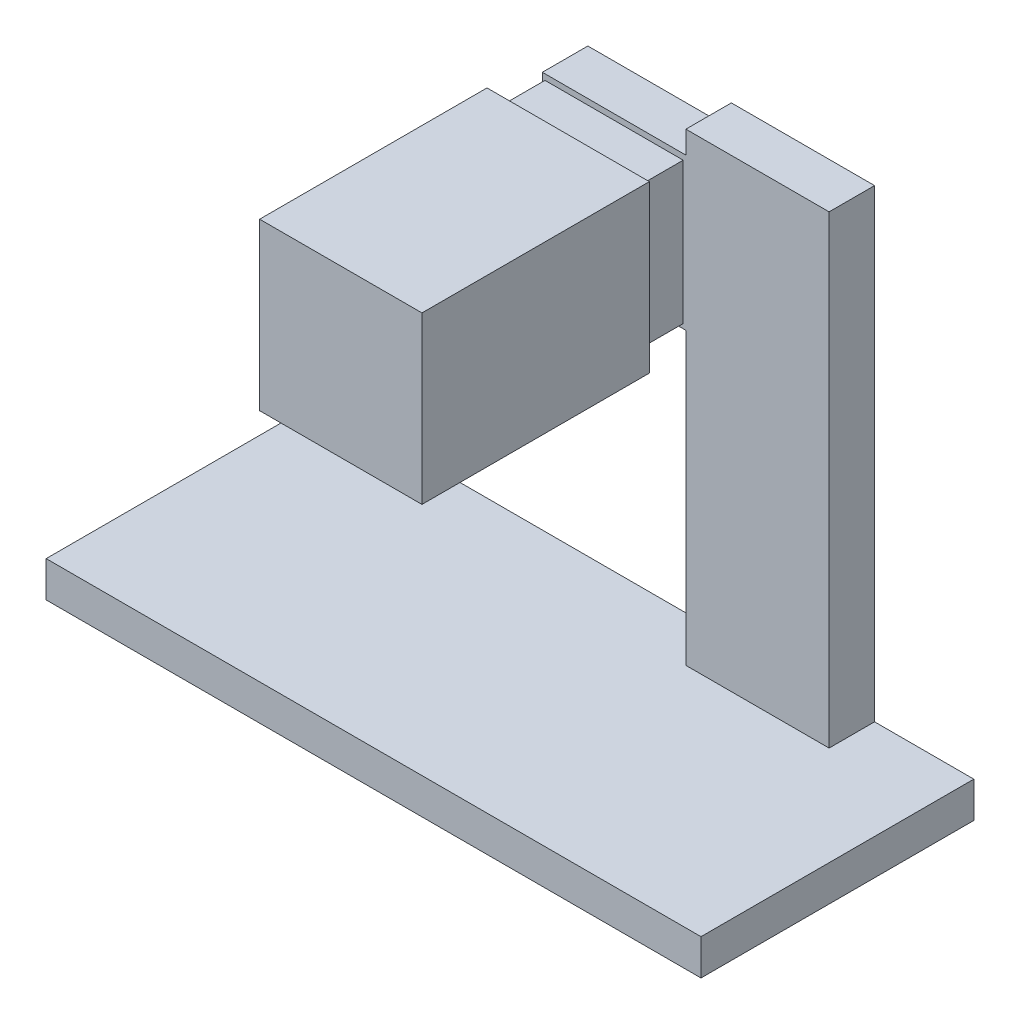
ISO-10303-21;
HEADER;
FILE_DESCRIPTION(('STEP AP214'),'2;1');
FILE_NAME('part.step','',(''),(''),'','','');
FILE_SCHEMA(('AUTOMOTIVE_DESIGN { 1 0 10303 214 1 1 1 1 }'));
ENDSEC;
DATA;
#1=APPLICATION_CONTEXT('core data for automotive mechanical design processes');
#2=APPLICATION_PROTOCOL_DEFINITION('international standard','automotive_design',2000,#1);
#3=PRODUCT_CONTEXT('',#1,'mechanical');
#4=PRODUCT('Part','Part','',(#3));
#5=PRODUCT_RELATED_PRODUCT_CATEGORY('part','',(#4));
#6=PRODUCT_DEFINITION_FORMATION('','',#4);
#7=PRODUCT_DEFINITION_CONTEXT('part definition',#1,'design');
#8=PRODUCT_DEFINITION('design','',#6,#7);
#9=PRODUCT_DEFINITION_SHAPE('','',#8);
#10=(LENGTH_UNIT() NAMED_UNIT(*) SI_UNIT(.MILLI.,.METRE.));
#11=(NAMED_UNIT(*) PLANE_ANGLE_UNIT() SI_UNIT($,.RADIAN.));
#12=(NAMED_UNIT(*) SI_UNIT($,.STERADIAN.) SOLID_ANGLE_UNIT());
#13=UNCERTAINTY_MEASURE_WITH_UNIT(LENGTH_MEASURE(1.E-05),#10,'distance_accuracy_value','');
#14=(GEOMETRIC_REPRESENTATION_CONTEXT(3) GLOBAL_UNCERTAINTY_ASSIGNED_CONTEXT((#13)) GLOBAL_UNIT_ASSIGNED_CONTEXT((#10,
#11,#12)) REPRESENTATION_CONTEXT('',''));
#15=CARTESIAN_POINT('',(0.,0.,0.));
#16=DIRECTION('',(0.,0.,1.));
#17=DIRECTION('',(1.,0.,0.));
#18=AXIS2_PLACEMENT_3D('',#15,#16,#17);
#19=CARTESIAN_POINT('',(115.159453347155,139.7,-63.5));
#20=DIRECTION('',(0.,0.,-1.));
#21=DIRECTION('',(-1.,0.,0.));
#22=AXIS2_PLACEMENT_3D('',#19,#20,#21);
#23=PLANE('',#22);
#24=DIRECTION('',(1.,0.,0.));
#25=VECTOR('',#24,1.);
#26=CARTESIAN_POINT('',(115.159453347155,10.,-63.5));
#27=LINE('',#26,#25);
#28=CARTESIAN_POINT('',(115.159453347155,10.,-63.5));
#29=VERTEX_POINT('',#28);
#30=CARTESIAN_POINT('',(155.159453347155,10.,-63.5));
#31=VERTEX_POINT('',#30);
#32=EDGE_CURVE('E268',#29,#31,#27,.T.);
#33=ORIENTED_EDGE('',*,*,#32,.T.);
#34=DIRECTION('',(0.,-1.,0.));
#35=VECTOR('',#34,1.);
#36=CARTESIAN_POINT('',(155.159453347155,139.7,-63.5));
#37=LINE('',#36,#35);
#38=CARTESIAN_POINT('',(155.159453347155,139.7,-63.5));
#39=VERTEX_POINT('',#38);
#40=EDGE_CURVE('E278',#39,#31,#37,.T.);
#41=ORIENTED_EDGE('',*,*,#40,.F.);
#42=DIRECTION('',(1.,0.,0.));
#43=VECTOR('',#42,1.);
#44=CARTESIAN_POINT('',(115.159453347155,139.7,-63.5));
#45=LINE('',#44,#43);
#46=CARTESIAN_POINT('',(115.159453347155,139.7,-63.5));
#47=VERTEX_POINT('',#46);
#48=EDGE_CURVE('E258',#47,#39,#45,.T.);
#49=ORIENTED_EDGE('',*,*,#48,.F.);
#50=DIRECTION('',(0.,-1.,0.));
#51=VECTOR('',#50,1.);
#52=CARTESIAN_POINT('',(115.159453347155,139.7,-63.5));
#53=LINE('',#52,#51);
#54=CARTESIAN_POINT('',(115.159453347155,133.419449067514,-63.5));
#55=VERTEX_POINT('',#54);
#56=EDGE_CURVE('E281',#47,#55,#53,.T.);
#57=ORIENTED_EDGE('',*,*,#56,.T.);
#58=DIRECTION('',(-1.,0.,0.));
#59=VECTOR('',#58,1.);
#60=CARTESIAN_POINT('',(155.159453347155,133.419449067514,-63.5));
#61=LINE('',#60,#59);
#62=CARTESIAN_POINT('',(75.0794906275856,133.419449067514,-63.5));
#63=VERTEX_POINT('',#62);
#64=EDGE_CURVE('E232',#55,#63,#61,.T.);
#65=ORIENTED_EDGE('',*,*,#64,.T.);
#66=DIRECTION('',(0.,-1.,0.));
#67=VECTOR('',#66,1.);
#68=CARTESIAN_POINT('',(75.0794906275856,133.419449067514,-63.5));
#69=LINE('',#68,#67);
#70=CARTESIAN_POINT('',(75.0794906275856,91.0398163558382,-63.5));
#71=VERTEX_POINT('',#70);
#72=EDGE_CURVE('E230',#63,#71,#69,.T.);
#73=ORIENTED_EDGE('',*,*,#72,.T.);
#74=DIRECTION('',(1.,0.,0.));
#75=VECTOR('',#74,1.);
#76=CARTESIAN_POINT('',(155.159453347155,91.0398163558382,-63.5));
#77=LINE('',#76,#75);
#78=CARTESIAN_POINT('',(115.159453347155,91.0398163558382,-63.5));
#79=VERTEX_POINT('',#78);
#80=EDGE_CURVE('E235',#71,#79,#77,.T.);
#81=ORIENTED_EDGE('',*,*,#80,.T.);
#82=EDGE_CURVE('E280',#79,#29,#53,.T.);
#83=ORIENTED_EDGE('',*,*,#82,.T.);
#84=EDGE_LOOP('',(#33,#41,#49,#57,#65,#73,#81,#83));
#85=FACE_BOUND('',#84,.T.);
#86=DIRECTION('',(0.,-1.,0.));
#87=VECTOR('',#86,1.);
#88=CARTESIAN_POINT('',(75.8098839809214,131.819675993885,-63.5));
#89=LINE('',#88,#87);
#90=CARTESIAN_POINT('',(75.8098839809214,131.819675993885,-63.5));
#91=VERTEX_POINT('',#90);
#92=CARTESIAN_POINT('',(75.8098839809214,92.3028154394274,-63.5));
#93=VERTEX_POINT('',#92);
#94=EDGE_CURVE('E193',#91,#93,#89,.T.);
#95=ORIENTED_EDGE('',*,*,#94,.F.);
#96=DIRECTION('',(-1.,0.,0.));
#97=VECTOR('',#96,1.);
#98=CARTESIAN_POINT('',(75.8098839809214,131.819675993885,-63.5));
#99=LINE('',#98,#97);
#100=CARTESIAN_POINT('',(114.410411537014,131.819675993885,-63.5));
#101=VERTEX_POINT('',#100);
#102=EDGE_CURVE('E205',#101,#91,#99,.T.);
#103=ORIENTED_EDGE('',*,*,#102,.F.);
#104=DIRECTION('',(0.,1.,0.));
#105=VECTOR('',#104,1.);
#106=CARTESIAN_POINT('',(114.410411537014,131.819675993885,-63.5));
#107=LINE('',#106,#105);
#108=CARTESIAN_POINT('',(114.410411537014,92.3028154394274,-63.5));
#109=VERTEX_POINT('',#108);
#110=EDGE_CURVE('E53',#109,#101,#107,.T.);
#111=ORIENTED_EDGE('',*,*,#110,.F.);
#112=DIRECTION('',(1.,0.,0.));
#113=VECTOR('',#112,1.);
#114=CARTESIAN_POINT('',(75.8098839809214,92.3028154394274,-63.5));
#115=LINE('',#114,#113);
#116=EDGE_CURVE('E48',#93,#109,#115,.T.);
#117=ORIENTED_EDGE('',*,*,#116,.F.);
#118=EDGE_LOOP('',(#95,#103,#111,#117));
#119=FACE_BOUND('',#118,.T.);
#120=ADVANCED_FACE('F33',(#85,#119),#23,.F.);
#121=CARTESIAN_POINT('',(115.159453347155,139.7,-76.2));
#122=DIRECTION('',(1.,0.,0.));
#123=DIRECTION('',(0.,0.,-1.));
#124=AXIS2_PLACEMENT_3D('',#121,#122,#123);
#125=PLANE('',#124);
#126=DIRECTION('',(0.,-1.,0.));
#127=VECTOR('',#126,1.);
#128=CARTESIAN_POINT('',(115.159453347155,139.7,-76.2));
#129=LINE('',#128,#127);
#130=CARTESIAN_POINT('',(115.159453347155,139.7,-76.2));
#131=VERTEX_POINT('',#130);
#132=CARTESIAN_POINT('',(115.159453347155,133.419449067514,-76.2));
#133=VERTEX_POINT('',#132);
#134=EDGE_CURVE('E273',#131,#133,#129,.T.);
#135=ORIENTED_EDGE('',*,*,#134,.T.);
#136=DIRECTION('',(0.,0.,1.));
#137=VECTOR('',#136,1.);
#138=CARTESIAN_POINT('',(115.159453347155,133.419449067514,-76.2));
#139=LINE('',#138,#137);
#140=EDGE_CURVE('E251',#133,#55,#139,.T.);
#141=ORIENTED_EDGE('',*,*,#140,.T.);
#142=ORIENTED_EDGE('',*,*,#56,.F.);
#143=DIRECTION('',(0.,0.,1.));
#144=VECTOR('',#143,1.);
#145=CARTESIAN_POINT('',(115.159453347155,139.7,-76.2));
#146=LINE('',#145,#144);
#147=EDGE_CURVE('E255',#131,#47,#146,.T.);
#148=ORIENTED_EDGE('',*,*,#147,.F.);
#149=EDGE_LOOP('',(#135,#141,#142,#148));
#150=FACE_BOUND('',#149,.T.);
#151=ADVANCED_FACE('F353',(#150),#125,.F.);
#152=CARTESIAN_POINT('',(0.,10.,0.));
#153=DIRECTION('',(0.,-1.,0.));
#154=DIRECTION('',(0.,0.,-1.));
#155=AXIS2_PLACEMENT_3D('',#152,#153,#154);
#156=PLANE('',#155);
#157=DIRECTION('',(0.,0.,1.));
#158=VECTOR('',#157,1.);
#159=CARTESIAN_POINT('',(115.159453347155,10.,-76.2));
#160=LINE('',#159,#158);
#161=CARTESIAN_POINT('',(115.159453347155,10.,-76.2));
#162=VERTEX_POINT('',#161);
#163=EDGE_CURVE('E254',#162,#29,#160,.T.);
#164=ORIENTED_EDGE('',*,*,#163,.F.);
#165=DIRECTION('',(-1.,0.,0.));
#166=VECTOR('',#165,1.);
#167=CARTESIAN_POINT('',(0.,10.,-76.2));
#168=LINE('',#167,#166);
#169=CARTESIAN_POINT('',(0.,10.,-76.2));
#170=VERTEX_POINT('',#169);
#171=EDGE_CURVE('E293',#162,#170,#168,.T.);
#172=ORIENTED_EDGE('',*,*,#171,.T.);
#173=DIRECTION('',(0.,0.,1.));
#174=VECTOR('',#173,1.);
#175=CARTESIAN_POINT('',(0.,10.,0.));
#176=LINE('',#175,#174);
#177=CARTESIAN_POINT('',(0.,10.,0.));
#178=VERTEX_POINT('',#177);
#179=EDGE_CURVE('E285',#170,#178,#176,.T.);
#180=ORIENTED_EDGE('',*,*,#179,.T.);
#181=DIRECTION('',(1.,0.,0.));
#182=VECTOR('',#181,1.);
#183=CARTESIAN_POINT('',(0.,10.,0.));
#184=LINE('',#183,#182);
#185=CARTESIAN_POINT('',(182.88,10.,0.));
#186=VERTEX_POINT('',#185);
#187=EDGE_CURVE('E288',#178,#186,#184,.T.);
#188=ORIENTED_EDGE('',*,*,#187,.T.);
#189=DIRECTION('',(0.,0.,-1.));
#190=VECTOR('',#189,1.);
#191=CARTESIAN_POINT('',(182.88,10.,0.));
#192=LINE('',#191,#190);
#193=CARTESIAN_POINT('',(182.88,10.,-76.2));
#194=VERTEX_POINT('',#193);
#195=EDGE_CURVE('E291',#186,#194,#192,.T.);
#196=ORIENTED_EDGE('',*,*,#195,.T.);
#197=CARTESIAN_POINT('',(155.159453347155,10.,-76.2));
#198=VERTEX_POINT('',#197);
#199=EDGE_CURVE('E294',#194,#198,#168,.T.);
#200=ORIENTED_EDGE('',*,*,#199,.T.);
#201=DIRECTION('',(0.,0.,-1.));
#202=VECTOR('',#201,1.);
#203=CARTESIAN_POINT('',(155.159453347155,10.,-76.2));
#204=LINE('',#203,#202);
#205=EDGE_CURVE('E259',#31,#198,#204,.T.);
#206=ORIENTED_EDGE('',*,*,#205,.F.);
#207=ORIENTED_EDGE('',*,*,#32,.F.);
#208=EDGE_LOOP('',(#164,#172,#180,#188,#196,#200,#206,#207));
#209=FACE_BOUND('',#208,.T.);
#210=ADVANCED_FACE('F332',(#209),#156,.F.);
#211=CARTESIAN_POINT('',(0.,10.,0.));
#212=DIRECTION('',(1.,0.,0.));
#213=DIRECTION('',(0.,0.,-1.));
#214=AXIS2_PLACEMENT_3D('',#211,#212,#213);
#215=PLANE('',#214);
#216=DIRECTION('',(0.,0.,1.));
#217=VECTOR('',#216,1.);
#218=CARTESIAN_POINT('',(0.,0.,0.));
#219=LINE('',#218,#217);
#220=CARTESIAN_POINT('',(0.,0.,-76.2));
#221=VERTEX_POINT('',#220);
#222=CARTESIAN_POINT('',(0.,0.,0.));
#223=VERTEX_POINT('',#222);
#224=EDGE_CURVE('E284',#221,#223,#219,.T.);
#225=ORIENTED_EDGE('',*,*,#224,.T.);
#226=DIRECTION('',(0.,-1.,0.));
#227=VECTOR('',#226,1.);
#228=CARTESIAN_POINT('',(0.,10.,0.));
#229=LINE('',#228,#227);
#230=EDGE_CURVE('E11',#178,#223,#229,.T.);
#231=ORIENTED_EDGE('',*,*,#230,.F.);
#232=ORIENTED_EDGE('',*,*,#179,.F.);
#233=DIRECTION('',(0.,-1.,0.));
#234=VECTOR('',#233,1.);
#235=CARTESIAN_POINT('',(0.,10.,-76.2));
#236=LINE('',#235,#234);
#237=EDGE_CURVE('E297',#170,#221,#236,.T.);
#238=ORIENTED_EDGE('',*,*,#237,.T.);
#239=EDGE_LOOP('',(#225,#231,#232,#238));
#240=FACE_BOUND('',#239,.T.);
#241=ADVANCED_FACE('F35',(#240),#215,.F.);
#242=CARTESIAN_POINT('',(0.,10.,0.));
#243=DIRECTION('',(0.,0.,-1.));
#244=DIRECTION('',(-1.,0.,0.));
#245=AXIS2_PLACEMENT_3D('',#242,#243,#244);
#246=PLANE('',#245);
#247=DIRECTION('',(1.,0.,0.));
#248=VECTOR('',#247,1.);
#249=CARTESIAN_POINT('',(0.,0.,0.));
#250=LINE('',#249,#248);
#251=CARTESIAN_POINT('',(182.88,0.,0.));
#252=VERTEX_POINT('',#251);
#253=EDGE_CURVE('E300',#223,#252,#250,.T.);
#254=ORIENTED_EDGE('',*,*,#253,.T.);
#255=DIRECTION('',(0.,-1.,0.));
#256=VECTOR('',#255,1.);
#257=CARTESIAN_POINT('',(182.88,10.,0.));
#258=LINE('',#257,#256);
#259=EDGE_CURVE('E41',#186,#252,#258,.T.);
#260=ORIENTED_EDGE('',*,*,#259,.F.);
#261=ORIENTED_EDGE('',*,*,#187,.F.);
#262=ORIENTED_EDGE('',*,*,#230,.T.);
#263=EDGE_LOOP('',(#254,#260,#261,#262));
#264=FACE_BOUND('',#263,.T.);
#265=ADVANCED_FACE('F387',(#264),#246,.F.);
#266=CARTESIAN_POINT('',(182.88,10.,0.));
#267=DIRECTION('',(-1.,0.,0.));
#268=DIRECTION('',(0.,0.,1.));
#269=AXIS2_PLACEMENT_3D('',#266,#267,#268);
#270=PLANE('',#269);
#271=DIRECTION('',(0.,0.,-1.));
#272=VECTOR('',#271,1.);
#273=CARTESIAN_POINT('',(182.88,0.,0.));
#274=LINE('',#273,#272);
#275=CARTESIAN_POINT('',(182.88,0.,-76.2));
#276=VERTEX_POINT('',#275);
#277=EDGE_CURVE('E302',#252,#276,#274,.T.);
#278=ORIENTED_EDGE('',*,*,#277,.T.);
#279=DIRECTION('',(0.,-1.,0.));
#280=VECTOR('',#279,1.);
#281=CARTESIAN_POINT('',(182.88,10.,-76.2));
#282=LINE('',#281,#280);
#283=EDGE_CURVE('E307',#194,#276,#282,.T.);
#284=ORIENTED_EDGE('',*,*,#283,.F.);
#285=ORIENTED_EDGE('',*,*,#195,.F.);
#286=ORIENTED_EDGE('',*,*,#259,.T.);
#287=EDGE_LOOP('',(#278,#284,#285,#286));
#288=FACE_BOUND('',#287,.T.);
#289=ADVANCED_FACE('F314',(#288),#270,.F.);
#290=CARTESIAN_POINT('',(0.,10.,-76.2));
#291=DIRECTION('',(0.,0.,1.));
#292=DIRECTION('',(1.,0.,0.));
#293=AXIS2_PLACEMENT_3D('',#290,#291,#292);
#294=PLANE('',#293);
#295=CARTESIAN_POINT('',(94.9880622735356,111.441174428668,-76.2));
#296=DIRECTION('',(0.,0.,1.));
#297=DIRECTION('',(1.,0.,0.));
#298=AXIS2_PLACEMENT_3D('',#295,#296,#297);
#299=CIRCLE('',#298,6.34999999999999);
#300=CARTESIAN_POINT('',(101.338062273536,111.441174428668,-76.2));
#301=VERTEX_POINT('',#300);
#302=EDGE_CURVE('E573',#301,#301,#299,.T.);
#303=ORIENTED_EDGE('',*,*,#302,.T.);
#304=EDGE_LOOP('',(#303));
#305=FACE_BOUND('',#304,.T.);
#306=CARTESIAN_POINT('',(115.159453347155,91.0398163558382,-76.2));
#307=VERTEX_POINT('',#306);
#308=EDGE_CURVE('E265',#307,#162,#129,.T.);
#309=ORIENTED_EDGE('',*,*,#308,.F.);
#310=DIRECTION('',(-1.,0.,0.));
#311=VECTOR('',#310,1.);
#312=CARTESIAN_POINT('',(155.159453347155,91.0398163558382,-76.2));
#313=LINE('',#312,#311);
#314=CARTESIAN_POINT('',(75.0794906275856,91.0398163558382,-76.2));
#315=VERTEX_POINT('',#314);
#316=EDGE_CURVE('E229',#307,#315,#313,.T.);
#317=ORIENTED_EDGE('',*,*,#316,.T.);
#318=DIRECTION('',(0.,1.,0.));
#319=VECTOR('',#318,1.);
#320=CARTESIAN_POINT('',(75.0794906275856,133.419449067514,-76.2));
#321=LINE('',#320,#319);
#322=CARTESIAN_POINT('',(75.0794906275856,133.419449067514,-76.2));
#323=VERTEX_POINT('',#322);
#324=EDGE_CURVE('E237',#315,#323,#321,.T.);
#325=ORIENTED_EDGE('',*,*,#324,.T.);
#326=DIRECTION('',(1.,0.,0.));
#327=VECTOR('',#326,1.);
#328=CARTESIAN_POINT('',(155.159453347155,133.419449067514,-76.2));
#329=LINE('',#328,#327);
#330=EDGE_CURVE('E240',#323,#133,#329,.T.);
#331=ORIENTED_EDGE('',*,*,#330,.T.);
#332=ORIENTED_EDGE('',*,*,#134,.F.);
#333=DIRECTION('',(-1.,0.,0.));
#334=VECTOR('',#333,1.);
#335=CARTESIAN_POINT('',(115.159453347155,139.7,-76.2));
#336=LINE('',#335,#334);
#337=CARTESIAN_POINT('',(155.159453347155,139.7,-76.2));
#338=VERTEX_POINT('',#337);
#339=EDGE_CURVE('E263',#338,#131,#336,.T.);
#340=ORIENTED_EDGE('',*,*,#339,.F.);
#341=DIRECTION('',(0.,-1.,0.));
#342=VECTOR('',#341,1.);
#343=CARTESIAN_POINT('',(155.159453347155,139.7,-76.2));
#344=LINE('',#343,#342);
#345=EDGE_CURVE('E276',#338,#198,#344,.T.);
#346=ORIENTED_EDGE('',*,*,#345,.T.);
#347=ORIENTED_EDGE('',*,*,#199,.F.);
#348=ORIENTED_EDGE('',*,*,#283,.T.);
#349=DIRECTION('',(-1.,0.,0.));
#350=VECTOR('',#349,1.);
#351=CARTESIAN_POINT('',(0.,0.,-76.2));
#352=LINE('',#351,#350);
#353=EDGE_CURVE('E289',#276,#221,#352,.T.);
#354=ORIENTED_EDGE('',*,*,#353,.T.);
#355=ORIENTED_EDGE('',*,*,#237,.F.);
#356=ORIENTED_EDGE('',*,*,#171,.F.);
#357=EDGE_LOOP('',(#309,#317,#325,#331,#332,#340,#346,#347,#348,#354,#355,#356));
#358=FACE_BOUND('',#357,.T.);
#359=ADVANCED_FACE('F324',(#305,#358),#294,.F.);
#360=CARTESIAN_POINT('',(0.,0.,0.));
#361=DIRECTION('',(0.,-1.,0.));
#362=DIRECTION('',(0.,0.,-1.));
#363=AXIS2_PLACEMENT_3D('',#360,#361,#362);
#364=PLANE('',#363);
#365=ORIENTED_EDGE('',*,*,#224,.F.);
#366=ORIENTED_EDGE('',*,*,#353,.F.);
#367=ORIENTED_EDGE('',*,*,#277,.F.);
#368=ORIENTED_EDGE('',*,*,#253,.F.);
#369=EDGE_LOOP('',(#365,#366,#367,#368));
#370=FACE_BOUND('',#369,.T.);
#371=ADVANCED_FACE('F320',(#370),#364,.T.);
#372=ORIENTED_EDGE('',*,*,#82,.F.);
#373=DIRECTION('',(0.,0.,-1.));
#374=VECTOR('',#373,1.);
#375=CARTESIAN_POINT('',(115.159453347155,91.0398163558382,-76.2));
#376=LINE('',#375,#374);
#377=EDGE_CURVE('E248',#79,#307,#376,.T.);
#378=ORIENTED_EDGE('',*,*,#377,.T.);
#379=ORIENTED_EDGE('',*,*,#308,.T.);
#380=ORIENTED_EDGE('',*,*,#163,.T.);
#381=EDGE_LOOP('',(#372,#378,#379,#380));
#382=FACE_BOUND('',#381,.T.);
#383=ADVANCED_FACE('F336',(#382),#125,.F.);
#384=CARTESIAN_POINT('',(155.159453347155,139.7,-76.2));
#385=DIRECTION('',(-1.,0.,0.));
#386=DIRECTION('',(0.,0.,1.));
#387=AXIS2_PLACEMENT_3D('',#384,#385,#386);
#388=PLANE('',#387);
#389=ORIENTED_EDGE('',*,*,#205,.T.);
#390=ORIENTED_EDGE('',*,*,#345,.F.);
#391=DIRECTION('',(0.,0.,-1.));
#392=VECTOR('',#391,1.);
#393=CARTESIAN_POINT('',(155.159453347155,139.7,-76.2));
#394=LINE('',#393,#392);
#395=EDGE_CURVE('E261',#39,#338,#394,.T.);
#396=ORIENTED_EDGE('',*,*,#395,.F.);
#397=ORIENTED_EDGE('',*,*,#40,.T.);
#398=EDGE_LOOP('',(#389,#390,#396,#397));
#399=FACE_BOUND('',#398,.T.);
#400=ADVANCED_FACE('F364',(#399),#388,.F.);
#401=CARTESIAN_POINT('',(0.,139.7,0.));
#402=DIRECTION('',(0.,1.,0.));
#403=DIRECTION('',(0.,0.,1.));
#404=AXIS2_PLACEMENT_3D('',#401,#402,#403);
#405=PLANE('',#404);
#406=ORIENTED_EDGE('',*,*,#147,.T.);
#407=ORIENTED_EDGE('',*,*,#48,.T.);
#408=ORIENTED_EDGE('',*,*,#395,.T.);
#409=ORIENTED_EDGE('',*,*,#339,.T.);
#410=EDGE_LOOP('',(#406,#407,#408,#409));
#411=FACE_BOUND('',#410,.T.);
#412=ADVANCED_FACE('F359',(#411),#405,.T.);
#413=CARTESIAN_POINT('',(155.159453347155,133.419449067514,27.1026141893497));
#414=DIRECTION('',(0.,1.,0.));
#415=DIRECTION('',(0.,0.,1.));
#416=AXIS2_PLACEMENT_3D('',#413,#414,#415);
#417=PLANE('',#416);
#418=ORIENTED_EDGE('',*,*,#140,.F.);
#419=ORIENTED_EDGE('',*,*,#330,.F.);
#420=DIRECTION('',(0.,0.,-1.));
#421=VECTOR('',#420,1.);
#422=CARTESIAN_POINT('',(75.0794906275856,133.419449067514,27.1026141893497));
#423=LINE('',#422,#421);
#424=EDGE_CURVE('E233',#63,#323,#423,.T.);
#425=ORIENTED_EDGE('',*,*,#424,.F.);
#426=ORIENTED_EDGE('',*,*,#64,.F.);
#427=EDGE_LOOP('',(#418,#419,#425,#426));
#428=FACE_BOUND('',#427,.T.);
#429=ADVANCED_FACE('F350',(#428),#417,.T.);
#430=CARTESIAN_POINT('',(155.159453347155,91.0398163558382,27.1026141893497));
#431=DIRECTION('',(0.,-1.,0.));
#432=DIRECTION('',(0.,0.,-1.));
#433=AXIS2_PLACEMENT_3D('',#430,#431,#432);
#434=PLANE('',#433);
#435=ORIENTED_EDGE('',*,*,#377,.F.);
#436=ORIENTED_EDGE('',*,*,#80,.F.);
#437=DIRECTION('',(0.,0.,-1.));
#438=VECTOR('',#437,1.);
#439=CARTESIAN_POINT('',(75.0794906275856,91.0398163558382,27.1026141893497));
#440=LINE('',#439,#438);
#441=EDGE_CURVE('E243',#71,#315,#440,.T.);
#442=ORIENTED_EDGE('',*,*,#441,.T.);
#443=ORIENTED_EDGE('',*,*,#316,.F.);
#444=EDGE_LOOP('',(#435,#436,#442,#443));
#445=FACE_BOUND('',#444,.T.);
#446=ADVANCED_FACE('F340',(#445),#434,.T.);
#447=CARTESIAN_POINT('',(75.0794906275856,133.419449067514,27.1026141893497));
#448=DIRECTION('',(-1.,0.,0.));
#449=DIRECTION('',(0.,0.,1.));
#450=AXIS2_PLACEMENT_3D('',#447,#448,#449);
#451=PLANE('',#450);
#452=ORIENTED_EDGE('',*,*,#72,.F.);
#453=ORIENTED_EDGE('',*,*,#424,.T.);
#454=ORIENTED_EDGE('',*,*,#324,.F.);
#455=ORIENTED_EDGE('',*,*,#441,.F.);
#456=EDGE_LOOP('',(#452,#453,#454,#455));
#457=FACE_BOUND('',#456,.T.);
#458=ADVANCED_FACE('F345',(#457),#451,.T.);
#459=CARTESIAN_POINT('',(75.8098839809214,131.819675993885,-50.8));
#460=DIRECTION('',(1.,0.,0.));
#461=DIRECTION('',(0.,0.,-1.));
#462=AXIS2_PLACEMENT_3D('',#459,#460,#461);
#463=PLANE('',#462);
#464=ORIENTED_EDGE('',*,*,#94,.T.);
#465=DIRECTION('',(0.,0.,-1.));
#466=VECTOR('',#465,1.);
#467=CARTESIAN_POINT('',(75.8098839809214,92.3028154394274,-50.8));
#468=LINE('',#467,#466);
#469=CARTESIAN_POINT('',(75.8098839809214,92.3028154394274,-50.8));
#470=VERTEX_POINT('',#469);
#471=EDGE_CURVE('E227',#470,#93,#468,.T.);
#472=ORIENTED_EDGE('',*,*,#471,.F.);
#473=DIRECTION('',(0.,-1.,0.));
#474=VECTOR('',#473,1.);
#475=CARTESIAN_POINT('',(75.8098839809214,131.819675993885,-50.8));
#476=LINE('',#475,#474);
#477=CARTESIAN_POINT('',(75.8098839809214,131.819675993885,-50.8));
#478=VERTEX_POINT('',#477);
#479=EDGE_CURVE('E201',#478,#470,#476,.T.);
#480=ORIENTED_EDGE('',*,*,#479,.F.);
#481=DIRECTION('',(0.,0.,-1.));
#482=VECTOR('',#481,1.);
#483=CARTESIAN_POINT('',(75.8098839809214,131.819675993885,-50.8));
#484=LINE('',#483,#482);
#485=EDGE_CURVE('E213',#478,#91,#484,.T.);
#486=ORIENTED_EDGE('',*,*,#485,.T.);
#487=EDGE_LOOP('',(#464,#472,#480,#486));
#488=FACE_BOUND('',#487,.T.);
#489=ADVANCED_FACE('F442',(#488),#463,.F.);
#490=CARTESIAN_POINT('',(75.8098839809214,92.3028154394274,-50.8));
#491=DIRECTION('',(0.,1.,0.));
#492=DIRECTION('',(0.,0.,1.));
#493=AXIS2_PLACEMENT_3D('',#490,#491,#492);
#494=PLANE('',#493);
#495=ORIENTED_EDGE('',*,*,#116,.T.);
#496=DIRECTION('',(0.,0.,-1.));
#497=VECTOR('',#496,1.);
#498=CARTESIAN_POINT('',(114.410411537014,92.3028154394274,-50.8));
#499=LINE('',#498,#497);
#500=CARTESIAN_POINT('',(114.410411537014,92.3028154394274,-50.8));
#501=VERTEX_POINT('',#500);
#502=EDGE_CURVE('E224',#501,#109,#499,.T.);
#503=ORIENTED_EDGE('',*,*,#502,.F.);
#504=DIRECTION('',(1.,0.,0.));
#505=VECTOR('',#504,1.);
#506=CARTESIAN_POINT('',(75.8098839809214,92.3028154394274,-50.8));
#507=LINE('',#506,#505);
#508=EDGE_CURVE('E204',#470,#501,#507,.T.);
#509=ORIENTED_EDGE('',*,*,#508,.F.);
#510=ORIENTED_EDGE('',*,*,#471,.T.);
#511=EDGE_LOOP('',(#495,#503,#509,#510));
#512=FACE_BOUND('',#511,.T.);
#513=ADVANCED_FACE('F457',(#512),#494,.F.);
#514=CARTESIAN_POINT('',(114.410411537014,131.819675993885,-50.8));
#515=DIRECTION('',(-1.,0.,0.));
#516=DIRECTION('',(0.,0.,1.));
#517=AXIS2_PLACEMENT_3D('',#514,#515,#516);
#518=PLANE('',#517);
#519=ORIENTED_EDGE('',*,*,#110,.T.);
#520=DIRECTION('',(0.,0.,-1.));
#521=VECTOR('',#520,1.);
#522=CARTESIAN_POINT('',(114.410411537014,131.819675993885,-50.8));
#523=LINE('',#522,#521);
#524=CARTESIAN_POINT('',(114.410411537014,131.819675993885,-50.8));
#525=VERTEX_POINT('',#524);
#526=EDGE_CURVE('E221',#525,#101,#523,.T.);
#527=ORIENTED_EDGE('',*,*,#526,.F.);
#528=DIRECTION('',(0.,1.,0.));
#529=VECTOR('',#528,1.);
#530=CARTESIAN_POINT('',(114.410411537014,131.819675993885,-50.8));
#531=LINE('',#530,#529);
#532=EDGE_CURVE('E208',#501,#525,#531,.T.);
#533=ORIENTED_EDGE('',*,*,#532,.F.);
#534=ORIENTED_EDGE('',*,*,#502,.T.);
#535=EDGE_LOOP('',(#519,#527,#533,#534));
#536=FACE_BOUND('',#535,.T.);
#537=ADVANCED_FACE('F467',(#536),#518,.F.);
#538=CARTESIAN_POINT('',(75.8098839809214,131.819675993885,-50.8));
#539=DIRECTION('',(0.,-1.,0.));
#540=DIRECTION('',(0.,0.,-1.));
#541=AXIS2_PLACEMENT_3D('',#538,#539,#540);
#542=PLANE('',#541);
#543=ORIENTED_EDGE('',*,*,#102,.T.);
#544=ORIENTED_EDGE('',*,*,#485,.F.);
#545=DIRECTION('',(-1.,0.,0.));
#546=VECTOR('',#545,1.);
#547=CARTESIAN_POINT('',(75.8098839809214,131.819675993885,-50.8));
#548=LINE('',#547,#546);
#549=EDGE_CURVE('E211',#525,#478,#548,.T.);
#550=ORIENTED_EDGE('',*,*,#549,.F.);
#551=ORIENTED_EDGE('',*,*,#526,.T.);
#552=EDGE_LOOP('',(#543,#544,#550,#551));
#553=FACE_BOUND('',#552,.T.);
#554=ADVANCED_FACE('F477',(#553),#542,.F.);
#555=CARTESIAN_POINT('',(0.,0.,-50.8));
#556=DIRECTION('',(0.,0.,1.));
#557=DIRECTION('',(1.,0.,0.));
#558=AXIS2_PLACEMENT_3D('',#555,#556,#557);
#559=PLANE('',#558);
#560=DIRECTION('',(0.,-1.,0.));
#561=VECTOR('',#560,1.);
#562=CARTESIAN_POINT('',(72.3198866370579,134.602136492025,-50.8));
#563=LINE('',#562,#561);
#564=CARTESIAN_POINT('',(72.3198866370579,134.602136492025,-50.8));
#565=VERTEX_POINT('',#564);
#566=CARTESIAN_POINT('',(72.3198866370579,88.2802123653101,-50.8));
#567=VERTEX_POINT('',#566);
#568=EDGE_CURVE('E192',#565,#567,#563,.T.);
#569=ORIENTED_EDGE('',*,*,#568,.F.);
#570=DIRECTION('',(-1.,0.,0.));
#571=VECTOR('',#570,1.);
#572=CARTESIAN_POINT('',(72.3198866370579,134.602136492025,-50.8));
#573=LINE('',#572,#571);
#574=CARTESIAN_POINT('',(117.656237910013,134.602136492025,-50.8));
#575=VERTEX_POINT('',#574);
#576=EDGE_CURVE('E188',#575,#565,#573,.T.);
#577=ORIENTED_EDGE('',*,*,#576,.F.);
#578=DIRECTION('',(0.,1.,0.));
#579=VECTOR('',#578,1.);
#580=CARTESIAN_POINT('',(117.656237910013,134.602136492025,-50.8));
#581=LINE('',#580,#579);
#582=CARTESIAN_POINT('',(117.656237910013,88.2802123653101,-50.8));
#583=VERTEX_POINT('',#582);
#584=EDGE_CURVE('E584',#583,#575,#581,.T.);
#585=ORIENTED_EDGE('',*,*,#584,.F.);
#586=DIRECTION('',(1.,0.,0.));
#587=VECTOR('',#586,1.);
#588=CARTESIAN_POINT('',(72.3198866370579,88.2802123653101,-50.8));
#589=LINE('',#588,#587);
#590=EDGE_CURVE('E582',#567,#583,#589,.T.);
#591=ORIENTED_EDGE('',*,*,#590,.F.);
#592=EDGE_LOOP('',(#569,#577,#585,#591));
#593=FACE_BOUND('',#592,.T.);
#594=ORIENTED_EDGE('',*,*,#549,.T.);
#595=ORIENTED_EDGE('',*,*,#479,.T.);
#596=ORIENTED_EDGE('',*,*,#508,.T.);
#597=ORIENTED_EDGE('',*,*,#532,.T.);
#598=EDGE_LOOP('',(#594,#595,#596,#597));
#599=FACE_BOUND('',#598,.T.);
#600=ADVANCED_FACE('F487',(#593,#599),#559,.F.);
#601=CARTESIAN_POINT('',(72.3198866370579,134.602136492025,12.7));
#602=DIRECTION('',(1.,0.,0.));
#603=DIRECTION('',(0.,0.,-1.));
#604=AXIS2_PLACEMENT_3D('',#601,#602,#603);
#605=PLANE('',#604);
#606=ORIENTED_EDGE('',*,*,#568,.T.);
#607=DIRECTION('',(0.,0.,-1.));
#608=VECTOR('',#607,1.);
#609=CARTESIAN_POINT('',(72.3198866370579,88.2802123653101,12.7));
#610=LINE('',#609,#608);
#611=CARTESIAN_POINT('',(72.3198866370579,88.2802123653101,12.7));
#612=VERTEX_POINT('',#611);
#613=EDGE_CURVE('E172',#612,#567,#610,.T.);
#614=ORIENTED_EDGE('',*,*,#613,.F.);
#615=DIRECTION('',(0.,-1.,0.));
#616=VECTOR('',#615,1.);
#617=CARTESIAN_POINT('',(72.3198866370579,134.602136492025,12.7));
#618=LINE('',#617,#616);
#619=CARTESIAN_POINT('',(72.3198866370579,134.602136492025,12.7));
#620=VERTEX_POINT('',#619);
#621=EDGE_CURVE('E179',#620,#612,#618,.T.);
#622=ORIENTED_EDGE('',*,*,#621,.F.);
#623=DIRECTION('',(0.,0.,-1.));
#624=VECTOR('',#623,1.);
#625=CARTESIAN_POINT('',(72.3198866370579,134.602136492025,12.7));
#626=LINE('',#625,#624);
#627=EDGE_CURVE('E580',#620,#565,#626,.T.);
#628=ORIENTED_EDGE('',*,*,#627,.T.);
#629=EDGE_LOOP('',(#606,#614,#622,#628));
#630=FACE_BOUND('',#629,.T.);
#631=ADVANCED_FACE('F190',(#630),#605,.F.);
#632=CARTESIAN_POINT('',(72.3198866370579,88.2802123653101,12.7));
#633=DIRECTION('',(0.,1.,0.));
#634=DIRECTION('',(0.,0.,1.));
#635=AXIS2_PLACEMENT_3D('',#632,#633,#634);
#636=PLANE('',#635);
#637=ORIENTED_EDGE('',*,*,#590,.T.);
#638=DIRECTION('',(0.,0.,-1.));
#639=VECTOR('',#638,1.);
#640=CARTESIAN_POINT('',(117.656237910013,88.2802123653101,12.7));
#641=LINE('',#640,#639);
#642=CARTESIAN_POINT('',(117.656237910013,88.2802123653101,12.7));
#643=VERTEX_POINT('',#642);
#644=EDGE_CURVE('E175',#643,#583,#641,.T.);
#645=ORIENTED_EDGE('',*,*,#644,.F.);
#646=DIRECTION('',(1.,0.,0.));
#647=VECTOR('',#646,1.);
#648=CARTESIAN_POINT('',(72.3198866370579,88.2802123653101,12.7));
#649=LINE('',#648,#647);
#650=EDGE_CURVE('E168',#612,#643,#649,.T.);
#651=ORIENTED_EDGE('',*,*,#650,.F.);
#652=ORIENTED_EDGE('',*,*,#613,.T.);
#653=EDGE_LOOP('',(#637,#645,#651,#652));
#654=FACE_BOUND('',#653,.T.);
#655=ADVANCED_FACE('F170',(#654),#636,.F.);
#656=CARTESIAN_POINT('',(117.656237910013,134.602136492025,12.7));
#657=DIRECTION('',(-1.,0.,0.));
#658=DIRECTION('',(0.,0.,1.));
#659=AXIS2_PLACEMENT_3D('',#656,#657,#658);
#660=PLANE('',#659);
#661=ORIENTED_EDGE('',*,*,#584,.T.);
#662=DIRECTION('',(0.,0.,-1.));
#663=VECTOR('',#662,1.);
#664=CARTESIAN_POINT('',(117.656237910013,134.602136492025,12.7));
#665=LINE('',#664,#663);
#666=CARTESIAN_POINT('',(117.656237910013,134.602136492025,12.7));
#667=VERTEX_POINT('',#666);
#668=EDGE_CURVE('E197',#667,#575,#665,.T.);
#669=ORIENTED_EDGE('',*,*,#668,.F.);
#670=DIRECTION('',(0.,1.,0.));
#671=VECTOR('',#670,1.);
#672=CARTESIAN_POINT('',(117.656237910013,134.602136492025,12.7));
#673=LINE('',#672,#671);
#674=EDGE_CURVE('E178',#643,#667,#673,.T.);
#675=ORIENTED_EDGE('',*,*,#674,.F.);
#676=ORIENTED_EDGE('',*,*,#644,.T.);
#677=EDGE_LOOP('',(#661,#669,#675,#676));
#678=FACE_BOUND('',#677,.T.);
#679=ADVANCED_FACE('F514',(#678),#660,.F.);
#680=CARTESIAN_POINT('',(72.3198866370579,134.602136492025,12.7));
#681=DIRECTION('',(0.,-1.,0.));
#682=DIRECTION('',(0.,0.,-1.));
#683=AXIS2_PLACEMENT_3D('',#680,#681,#682);
#684=PLANE('',#683);
#685=ORIENTED_EDGE('',*,*,#576,.T.);
#686=ORIENTED_EDGE('',*,*,#627,.F.);
#687=DIRECTION('',(-1.,0.,0.));
#688=VECTOR('',#687,1.);
#689=CARTESIAN_POINT('',(72.3198866370579,134.602136492025,12.7));
#690=LINE('',#689,#688);
#691=EDGE_CURVE('E184',#667,#620,#690,.T.);
#692=ORIENTED_EDGE('',*,*,#691,.F.);
#693=ORIENTED_EDGE('',*,*,#668,.T.);
#694=EDGE_LOOP('',(#685,#686,#692,#693));
#695=FACE_BOUND('',#694,.T.);
#696=ADVANCED_FACE('F523',(#695),#684,.F.);
#697=CARTESIAN_POINT('',(0.,0.,12.7));
#698=DIRECTION('',(0.,0.,1.));
#699=DIRECTION('',(1.,0.,0.));
#700=AXIS2_PLACEMENT_3D('',#697,#698,#699);
#701=PLANE('',#700);
#702=ORIENTED_EDGE('',*,*,#621,.T.);
#703=ORIENTED_EDGE('',*,*,#650,.T.);
#704=ORIENTED_EDGE('',*,*,#674,.T.);
#705=ORIENTED_EDGE('',*,*,#691,.T.);
#706=EDGE_LOOP('',(#702,#703,#704,#705));
#707=FACE_BOUND('',#706,.T.);
#708=ADVANCED_FACE('F182',(#707),#701,.T.);
#709=CARTESIAN_POINT('',(94.9880622735356,111.441174428668,-86.36));
#710=DIRECTION('',(0.,0.,1.));
#711=DIRECTION('',(1.,0.,0.));
#712=AXIS2_PLACEMENT_3D('',#709,#710,#711);
#713=CYLINDRICAL_SURFACE('',#712,6.34999999999999);
#714=CARTESIAN_POINT('',(94.9880622735356,111.441174428668,-86.36));
#715=DIRECTION('',(0.,0.,1.));
#716=DIRECTION('',(1.,0.,0.));
#717=AXIS2_PLACEMENT_3D('',#714,#715,#716);
#718=CIRCLE('',#717,6.34999999999999);
#719=CARTESIAN_POINT('',(101.338062273536,111.441174428668,-86.36));
#720=VERTEX_POINT('',#719);
#721=EDGE_CURVE('E572',#720,#720,#718,.T.);
#722=ORIENTED_EDGE('',*,*,#721,.T.);
#723=EDGE_LOOP('',(#722));
#724=FACE_BOUND('',#723,.T.);
#725=ORIENTED_EDGE('',*,*,#302,.F.);
#726=EDGE_LOOP('',(#725));
#727=FACE_BOUND('',#726,.T.);
#728=ADVANCED_FACE('F547',(#724,#727),#713,.T.);
#729=CARTESIAN_POINT('',(94.9880622735356,111.441174428668,-86.36));
#730=DIRECTION('',(0.,0.,1.));
#731=DIRECTION('',(1.,0.,0.));
#732=AXIS2_PLACEMENT_3D('',#729,#730,#731);
#733=PLANE('',#732);
#734=ORIENTED_EDGE('',*,*,#721,.F.);
#735=EDGE_LOOP('',(#734));
#736=FACE_BOUND('',#735,.T.);
#737=ADVANCED_FACE('F556',(#736),#733,.F.);
#738=CLOSED_SHELL('',(#120,#151,#210,#241,#265,#289,#359,#371,#383,#400,#412,#429,#446,#458,
#489,#513,#537,#554,#600,#631,#655,#679,#696,#708,#728,#737));
#739=MANIFOLD_SOLID_BREP('B2',#738);
#740=ADVANCED_BREP_SHAPE_REPRESENTATION('',(#18,#739),#14);
#741=SHAPE_DEFINITION_REPRESENTATION(#9,#740);
ENDSEC;
END-ISO-10303-21;
